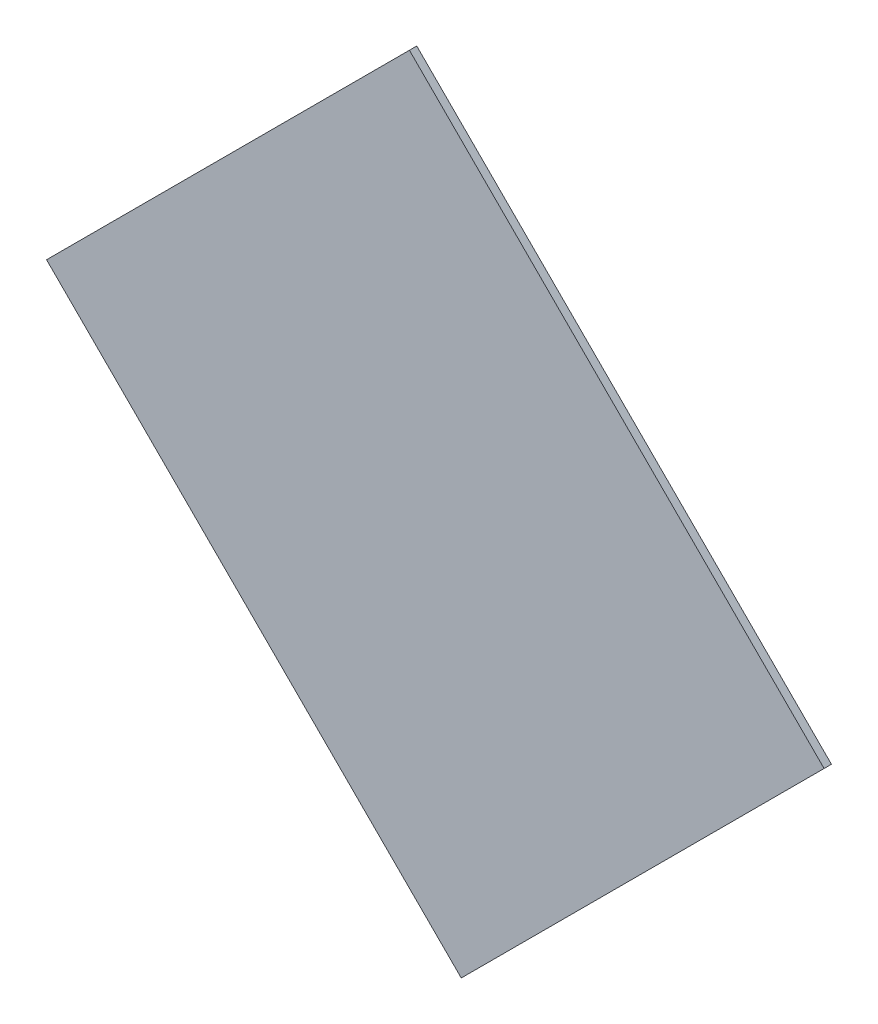
ISO-10303-21;
HEADER;
FILE_DESCRIPTION(('STEP AP214'),'2;1');
FILE_NAME('part.step','',(''),(''),'','','');
FILE_SCHEMA(('AUTOMOTIVE_DESIGN { 1 0 10303 214 1 1 1 1 }'));
ENDSEC;
DATA;
#1=APPLICATION_CONTEXT('core data for automotive mechanical design processes');
#2=APPLICATION_PROTOCOL_DEFINITION('international standard','automotive_design',2000,#1);
#3=PRODUCT_CONTEXT('',#1,'mechanical');
#4=PRODUCT('Part','Part','',(#3));
#5=PRODUCT_RELATED_PRODUCT_CATEGORY('part','',(#4));
#6=PRODUCT_DEFINITION_FORMATION('','',#4);
#7=PRODUCT_DEFINITION_CONTEXT('part definition',#1,'design');
#8=PRODUCT_DEFINITION('design','',#6,#7);
#9=PRODUCT_DEFINITION_SHAPE('','',#8);
#10=(LENGTH_UNIT() NAMED_UNIT(*) SI_UNIT(.MILLI.,.METRE.));
#11=(NAMED_UNIT(*) PLANE_ANGLE_UNIT() SI_UNIT($,.RADIAN.));
#12=(NAMED_UNIT(*) SI_UNIT($,.STERADIAN.) SOLID_ANGLE_UNIT());
#13=UNCERTAINTY_MEASURE_WITH_UNIT(LENGTH_MEASURE(1.E-05),#10,'distance_accuracy_value','');
#14=(GEOMETRIC_REPRESENTATION_CONTEXT(3) GLOBAL_UNCERTAINTY_ASSIGNED_CONTEXT((#13)) GLOBAL_UNIT_ASSIGNED_CONTEXT((#10,
#11,#12)) REPRESENTATION_CONTEXT('',''));
#15=CARTESIAN_POINT('',(0.,0.,0.));
#16=DIRECTION('',(0.,0.,1.));
#17=DIRECTION('',(1.,0.,0.));
#18=AXIS2_PLACEMENT_3D('',#15,#16,#17);
#19=CARTESIAN_POINT('',(9.899999999999,7.928329999999,0.80916));
#20=DIRECTION('',(-1.450297221417E-10,-1.450297221417E-10,1.));
#21=DIRECTION('',(1.,0.,1.450297221417E-10));
#22=AXIS2_PLACEMENT_3D('',#19,#20,#21);
#23=PLANE('',#22);
#24=DIRECTION('',(0.707106781186548,0.707106781186548,0.));
#25=VECTOR('',#24,1.);
#26=CARTESIAN_POINT('',(10.713172798363,7.751553304702,0.809160000236));
#27=LINE('',#26,#25);
#28=CARTESIAN_POINT('',(11.2081475451943,8.2465280515325,0.809160000235967));
#29=VERTEX_POINT('',#28);
#30=CARTESIAN_POINT('',(10.7131727983631,7.75155330470188,0.809160000164074));
#31=VERTEX_POINT('',#30);
#32=EDGE_CURVE('E55',#29,#31,#27,.F.);
#33=ORIENTED_EDGE('',*,*,#32,.T.);
#34=DIRECTION('',(-0.707106781186548,0.707106781186548,0.));
#35=VECTOR('',#34,1.);
#36=CARTESIAN_POINT('',(11.278858223312,7.185867879753,0.809160000092));
#37=LINE('',#36,#35);
#38=CARTESIAN_POINT('',(11.2788582233124,7.18586787975338,0.809160000092074));
#39=VERTEX_POINT('',#38);
#40=EDGE_CURVE('E76',#31,#39,#37,.F.);
#41=ORIENTED_EDGE('',*,*,#40,.T.);
#42=DIRECTION('',(-0.707106781186548,-0.707106781186548,0.));
#43=VECTOR('',#42,1.);
#44=CARTESIAN_POINT('',(11.278858223312,7.185867879753,0.809160000092));
#45=LINE('',#44,#43);
#46=CARTESIAN_POINT('',(11.7738329701428,7.68084262658325,0.809160000199934));
#47=VERTEX_POINT('',#46);
#48=EDGE_CURVE('E58',#39,#47,#45,.F.);
#49=ORIENTED_EDGE('',*,*,#48,.T.);
#50=DIRECTION('',(0.707106781186548,-0.707106781186548,0.));
#51=VECTOR('',#50,1.);
#52=CARTESIAN_POINT('',(11.773832970143,7.680842626583,0.809160000236));
#53=LINE('',#52,#51);
#54=EDGE_CURVE('E20',#47,#29,#53,.F.);
#55=ORIENTED_EDGE('',*,*,#54,.T.);
#56=EDGE_LOOP('',(#33,#41,#49,#55));
#57=FACE_BOUND('',#56,.T.);
#58=ADVANCED_FACE('F17',(#57),#23,.T.);
#59=CARTESIAN_POINT('',(11.773832970143,7.680842626583,0.809160000236));
#60=DIRECTION('',(-0.707106781186548,-0.707106781186548,-2.05102999999869E-10));
#61=DIRECTION('',(0.707106781186548,-0.707106781186548,0.));
#62=AXIS2_PLACEMENT_3D('',#59,#60,#61);
#63=PLANE('',#62);
#64=DIRECTION('',(0.,0.,1.));
#65=VECTOR('',#64,1.);
#66=CARTESIAN_POINT('',(11.208147545195,8.246528051534,0.809160000092));
#67=LINE('',#66,#65);
#68=CARTESIAN_POINT('',(11.2081475451952,8.24652805153372,0.799160000199967));
#69=VERTEX_POINT('',#68);
#70=EDGE_CURVE('E63',#69,#29,#67,.T.);
#71=ORIENTED_EDGE('',*,*,#70,.T.);
#72=ORIENTED_EDGE('',*,*,#54,.F.);
#73=DIRECTION('',(0.,0.,1.));
#74=VECTOR('',#73,1.);
#75=CARTESIAN_POINT('',(11.7738329701425,7.6808426265835,0.809160000092));
#76=LINE('',#75,#74);
#77=CARTESIAN_POINT('',(11.7738329701436,7.6808426265846,0.799160000235967));
#78=VERTEX_POINT('',#77);
#79=EDGE_CURVE('E80',#47,#78,#76,.F.);
#80=ORIENTED_EDGE('',*,*,#79,.T.);
#81=DIRECTION('',(-0.707106781186547,0.707106781186548,0.));
#82=VECTOR('',#81,1.);
#83=CARTESIAN_POINT('',(11.773832970144,7.680842626585,0.799160000235868));
#84=LINE('',#83,#82);
#85=EDGE_CURVE('E73',#78,#69,#84,.T.);
#86=ORIENTED_EDGE('',*,*,#85,.T.);
#87=EDGE_LOOP('',(#71,#72,#80,#86));
#88=FACE_BOUND('',#87,.T.);
#89=ADVANCED_FACE('F72',(#88),#63,.F.);
#90=CARTESIAN_POINT('',(10.713172798363,7.751553304702,0.809160000092));
#91=DIRECTION('',(0.707106781186548,-0.707106781186548,0.));
#92=DIRECTION('',(0.707106781186548,0.707106781186548,0.));
#93=AXIS2_PLACEMENT_3D('',#90,#91,#92);
#94=PLANE('',#93);
#95=DIRECTION('',(-1.45029722141612E-10,-1.45029722141612E-10,1.));
#96=VECTOR('',#95,1.);
#97=CARTESIAN_POINT('',(10.7131727983635,7.7515533047015,0.809160000092));
#98=LINE('',#97,#96);
#99=CARTESIAN_POINT('',(10.713172798364,7.75155330470249,0.799160000092074));
#100=VERTEX_POINT('',#99);
#101=EDGE_CURVE('E69',#100,#31,#98,.T.);
#102=ORIENTED_EDGE('',*,*,#101,.T.);
#103=ORIENTED_EDGE('',*,*,#32,.F.);
#104=ORIENTED_EDGE('',*,*,#70,.F.);
#105=DIRECTION('',(-0.707106781185834,-0.707106781187261,-2.05103171549856E-10));
#106=VECTOR('',#105,1.);
#107=CARTESIAN_POINT('',(11.208147545195,8.246528051534,0.799160000235869));
#108=LINE('',#107,#106);
#109=EDGE_CURVE('E83',#69,#100,#108,.T.);
#110=ORIENTED_EDGE('',*,*,#109,.T.);
#111=EDGE_LOOP('',(#102,#103,#104,#110));
#112=FACE_BOUND('',#111,.T.);
#113=ADVANCED_FACE('F66',(#112),#94,.F.);
#114=CARTESIAN_POINT('',(11.278858223312,7.185867879753,0.809160000092));
#115=DIRECTION('',(0.707106781186548,0.707106781186548,2.05102999999869E-10));
#116=DIRECTION('',(-0.707106781186548,0.707106781186548,0.));
#117=AXIS2_PLACEMENT_3D('',#114,#115,#116);
#118=PLANE('',#117);
#119=DIRECTION('',(0.,0.,1.));
#120=VECTOR('',#119,1.);
#121=CARTESIAN_POINT('',(11.2788582233135,7.1858678797545,0.809160000092));
#122=LINE('',#121,#120);
#123=CARTESIAN_POINT('',(11.2788582233136,7.18586787975435,0.799160000128074));
#124=VERTEX_POINT('',#123);
#125=EDGE_CURVE('E34',#124,#39,#122,.T.);
#126=ORIENTED_EDGE('',*,*,#125,.T.);
#127=ORIENTED_EDGE('',*,*,#40,.F.);
#128=ORIENTED_EDGE('',*,*,#101,.F.);
#129=DIRECTION('',(0.707106781186549,-0.707106781186546,0.));
#130=VECTOR('',#129,1.);
#131=CARTESIAN_POINT('',(10.713172798365,7.751553304703,0.799160000092296));
#132=LINE('',#131,#130);
#133=EDGE_CURVE('E26',#100,#124,#132,.T.);
#134=ORIENTED_EDGE('',*,*,#133,.T.);
#135=EDGE_LOOP('',(#126,#127,#128,#134));
#136=FACE_BOUND('',#135,.T.);
#137=ADVANCED_FACE('F88',(#136),#118,.F.);
#138=CARTESIAN_POINT('',(11.278858223312,7.185867879753,0.809160000092));
#139=DIRECTION('',(-0.707106781186548,0.707106781186548,0.));
#140=DIRECTION('',(-0.707106781186548,-0.707106781186548,0.));
#141=AXIS2_PLACEMENT_3D('',#138,#139,#140);
#142=PLANE('',#141);
#143=ORIENTED_EDGE('',*,*,#79,.F.);
#144=ORIENTED_EDGE('',*,*,#48,.F.);
#145=ORIENTED_EDGE('',*,*,#125,.F.);
#146=DIRECTION('',(0.707106781185833,0.707106781187262,2.05102861777808E-10));
#147=VECTOR('',#146,1.);
#148=CARTESIAN_POINT('',(11.278858223314,7.185867879754,0.799160000092296));
#149=LINE('',#148,#147);
#150=EDGE_CURVE('E11',#124,#78,#149,.T.);
#151=ORIENTED_EDGE('',*,*,#150,.T.);
#152=EDGE_LOOP('',(#143,#144,#145,#151));
#153=FACE_BOUND('',#152,.T.);
#154=ADVANCED_FACE('F91',(#153),#142,.F.);
#155=CARTESIAN_POINT('',(9.9,7.92833,0.79916));
#156=DIRECTION('',(-1.450297221417E-10,-1.450297221417E-10,1.));
#157=DIRECTION('',(1.,0.,1.450297221417E-10));
#158=AXIS2_PLACEMENT_3D('',#155,#156,#157);
#159=PLANE('',#158);
#160=ORIENTED_EDGE('',*,*,#133,.F.);
#161=ORIENTED_EDGE('',*,*,#109,.F.);
#162=ORIENTED_EDGE('',*,*,#85,.F.);
#163=ORIENTED_EDGE('',*,*,#150,.F.);
#164=EDGE_LOOP('',(#160,#161,#162,#163));
#165=FACE_BOUND('',#164,.T.);
#166=ADVANCED_FACE('F90',(#165),#159,.F.);
#167=CLOSED_SHELL('',(#58,#89,#113,#137,#154,#166));
#168=MANIFOLD_SOLID_BREP('B1',#167);
#169=ADVANCED_BREP_SHAPE_REPRESENTATION('',(#18,#168),#14);
#170=SHAPE_DEFINITION_REPRESENTATION(#9,#169);
ENDSEC;
END-ISO-10303-21;
